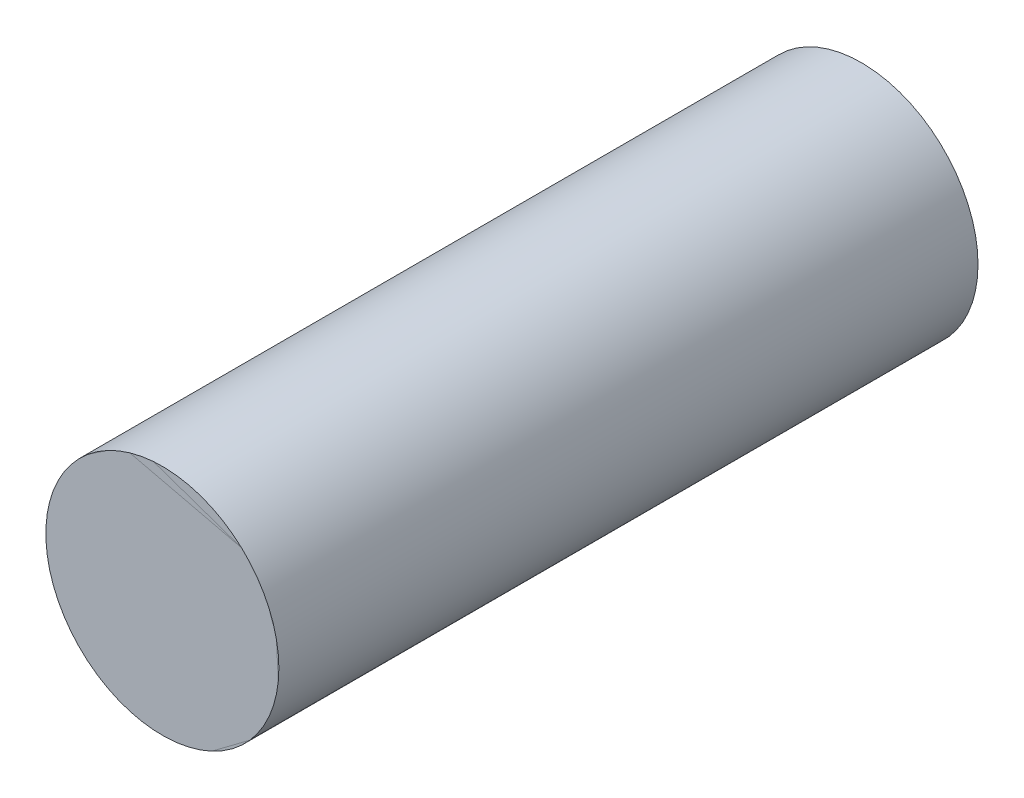
ISO-10303-21;
HEADER;
FILE_DESCRIPTION(('STEP AP214'),'2;1');
FILE_NAME('part.step','',(''),(''),'','','');
FILE_SCHEMA(('AUTOMOTIVE_DESIGN { 1 0 10303 214 1 1 1 1 }'));
ENDSEC;
DATA;
#1=APPLICATION_CONTEXT('core data for automotive mechanical design processes');
#2=APPLICATION_PROTOCOL_DEFINITION('international standard','automotive_design',2000,#1);
#3=PRODUCT_CONTEXT('',#1,'mechanical');
#4=PRODUCT('Part','Part','',(#3));
#5=PRODUCT_RELATED_PRODUCT_CATEGORY('part','',(#4));
#6=PRODUCT_DEFINITION_FORMATION('','',#4);
#7=PRODUCT_DEFINITION_CONTEXT('part definition',#1,'design');
#8=PRODUCT_DEFINITION('design','',#6,#7);
#9=PRODUCT_DEFINITION_SHAPE('','',#8);
#10=(LENGTH_UNIT() NAMED_UNIT(*) SI_UNIT(.MILLI.,.METRE.));
#11=(NAMED_UNIT(*) PLANE_ANGLE_UNIT() SI_UNIT($,.RADIAN.));
#12=(NAMED_UNIT(*) SI_UNIT($,.STERADIAN.) SOLID_ANGLE_UNIT());
#13=UNCERTAINTY_MEASURE_WITH_UNIT(LENGTH_MEASURE(1.E-05),#10,'distance_accuracy_value','');
#14=(GEOMETRIC_REPRESENTATION_CONTEXT(3) GLOBAL_UNCERTAINTY_ASSIGNED_CONTEXT((#13)) GLOBAL_UNIT_ASSIGNED_CONTEXT((#10,
#11,#12)) REPRESENTATION_CONTEXT('',''));
#15=CARTESIAN_POINT('',(0.,0.,0.));
#16=DIRECTION('',(0.,0.,1.));
#17=DIRECTION('',(1.,0.,0.));
#18=AXIS2_PLACEMENT_3D('',#15,#16,#17);
#19=CARTESIAN_POINT('',(-127.923352159799,-32.5039777719793,-7.54999999999981));
#20=DIRECTION('',(0.,0.,1.));
#21=DIRECTION('',(1.,0.,0.));
#22=AXIS2_PLACEMENT_3D('',#19,#20,#21);
#23=CYLINDRICAL_SURFACE('',#22,0.300000000000011);
#24=CARTESIAN_POINT('',(-127.923352159799,-32.5039777719793,-7.54999999999981));
#25=DIRECTION('',(0.,0.,1.));
#26=DIRECTION('',(1.,0.,0.));
#27=AXIS2_PLACEMENT_3D('',#24,#25,#26);
#28=CIRCLE('',#27,0.300000000000011);
#29=CARTESIAN_POINT('',(-127.623352159799,-32.5039777719793,-7.54999999999981));
#30=VERTEX_POINT('',#29);
#31=EDGE_CURVE('E11',#30,#30,#28,.T.);
#32=ORIENTED_EDGE('',*,*,#31,.T.);
#33=EDGE_LOOP('',(#32));
#34=FACE_BOUND('',#33,.T.);
#35=CARTESIAN_POINT('',(-127.923352159799,-32.5039777719793,-5.74999999999981));
#36=DIRECTION('',(0.,0.,1.));
#37=DIRECTION('',(1.,0.,0.));
#38=AXIS2_PLACEMENT_3D('',#35,#36,#37);
#39=CIRCLE('',#38,0.300000000000011);
#40=CARTESIAN_POINT('',(-127.623352159799,-32.5039777719793,-5.74999999999981));
#41=VERTEX_POINT('',#40);
#42=EDGE_CURVE('E46',#41,#41,#39,.T.);
#43=ORIENTED_EDGE('',*,*,#42,.F.);
#44=EDGE_LOOP('',(#43));
#45=FACE_BOUND('',#44,.T.);
#46=ADVANCED_FACE('F43',(#34,#45),#23,.T.);
#47=CARTESIAN_POINT('',(-127.923352159799,-32.5039777719793,-7.54999999999981));
#48=DIRECTION('',(0.,0.,1.));
#49=DIRECTION('',(1.,0.,0.));
#50=AXIS2_PLACEMENT_3D('',#47,#48,#49);
#51=PLANE('',#50);
#52=ORIENTED_EDGE('',*,*,#31,.F.);
#53=EDGE_LOOP('',(#52));
#54=FACE_BOUND('',#53,.T.);
#55=ADVANCED_FACE('F58',(#54),#51,.F.);
#56=CARTESIAN_POINT('',(-127.923352159799,-32.5039777719793,-5.74999999999981));
#57=DIRECTION('',(0.,0.,1.));
#58=DIRECTION('',(1.,0.,0.));
#59=AXIS2_PLACEMENT_3D('',#56,#57,#58);
#60=PLANE('',#59);
#61=ORIENTED_EDGE('',*,*,#42,.T.);
#62=EDGE_LOOP('',(#61));
#63=FACE_BOUND('',#62,.T.);
#64=ADVANCED_FACE('F55',(#63),#60,.T.);
#65=CLOSED_SHELL('',(#46,#55,#64));
#66=MANIFOLD_SOLID_BREP('B2',#65);
#67=CARTESIAN_POINT('',(-127.923352159799,-32.5039777719793,-5.74999999999981));
#68=DIRECTION('',(0.,0.,1.));
#69=DIRECTION('',(1.,0.,0.));
#70=AXIS2_PLACEMENT_3D('',#67,#68,#69);
#71=PLANE('',#70);
#72=CARTESIAN_POINT('',(-127.923352159799,-32.5039777719793,-5.74999999999981));
#73=DIRECTION('',(0.,0.,1.));
#74=DIRECTION('',(1.,0.,0.));
#75=AXIS2_PLACEMENT_3D('',#72,#73,#74);
#76=CIRCLE('',#75,0.299999999999995);
#77=CARTESIAN_POINT('',(-127.623352159799,-32.5039777719793,-5.74999999999981));
#78=VERTEX_POINT('',#77);
#79=EDGE_CURVE('E42',#78,#78,#76,.F.);
#80=ORIENTED_EDGE('',*,*,#79,.F.);
#81=EDGE_LOOP('',(#80));
#82=FACE_BOUND('',#81,.T.);
#83=ADVANCED_FACE('F83',(#82),#71,.T.);
#84=OPEN_SHELL('',(#83));
#85=SHELL_BASED_SURFACE_MODEL('B6',(#84));
#86=ADVANCED_BREP_SHAPE_REPRESENTATION('',(#18,#66),#14);
#87=MANIFOLD_SURFACE_SHAPE_REPRESENTATION('',(#18,#85),#14);
#88=SHAPE_REPRESENTATION('',(#18),#14);
#89=SHAPE_DEFINITION_REPRESENTATION(#9,#88);
#90=SHAPE_REPRESENTATION_RELATIONSHIP('','',#88,#86);
#91=SHAPE_REPRESENTATION_RELATIONSHIP('','',#88,#87);
ENDSEC;
END-ISO-10303-21;
